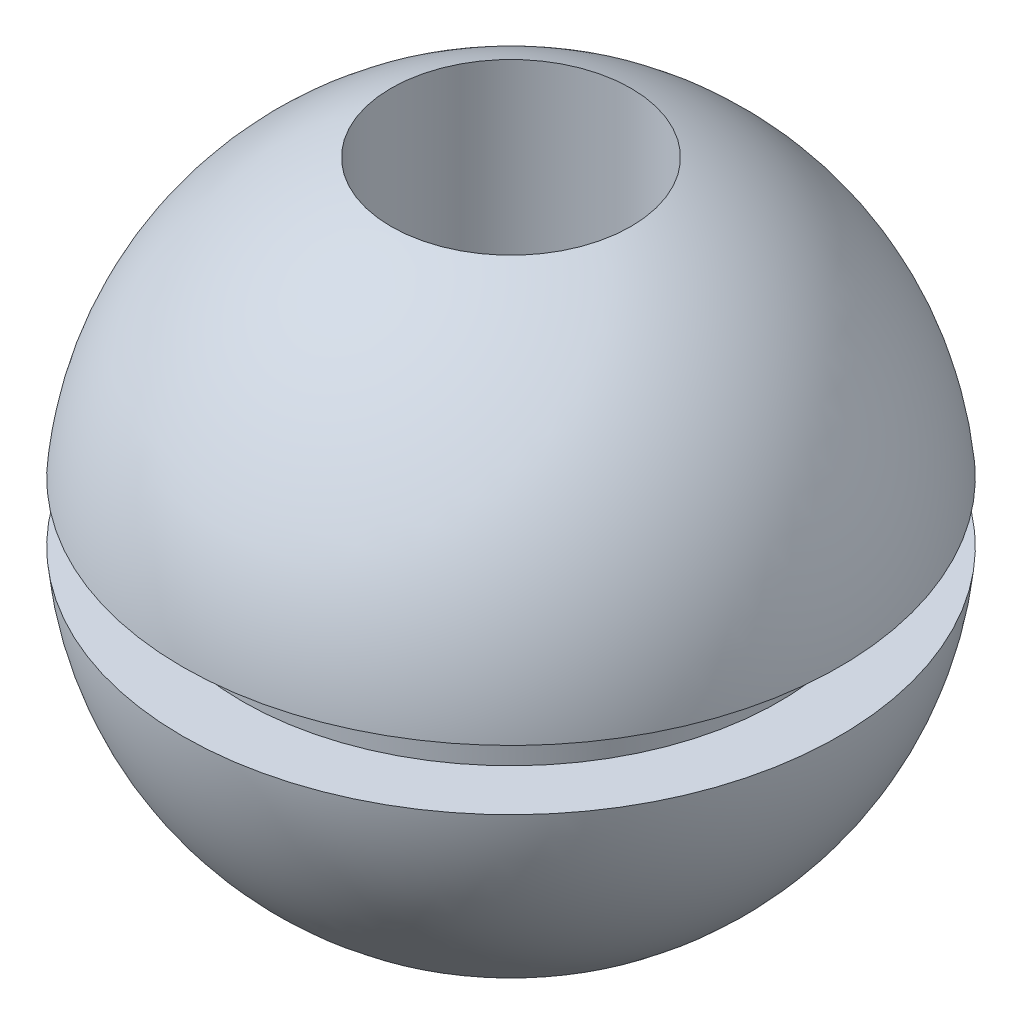
ISO-10303-21;
HEADER;
FILE_DESCRIPTION(('STEP AP214'),'2;1');
FILE_NAME('part.step','',(''),(''),'','','');
FILE_SCHEMA(('AUTOMOTIVE_DESIGN { 1 0 10303 214 1 1 1 1 }'));
ENDSEC;
DATA;
#1=APPLICATION_CONTEXT('core data for automotive mechanical design processes');
#2=APPLICATION_PROTOCOL_DEFINITION('international standard','automotive_design',2000,#1);
#3=PRODUCT_CONTEXT('',#1,'mechanical');
#4=PRODUCT('Part','Part','',(#3));
#5=PRODUCT_RELATED_PRODUCT_CATEGORY('part','',(#4));
#6=PRODUCT_DEFINITION_FORMATION('','',#4);
#7=PRODUCT_DEFINITION_CONTEXT('part definition',#1,'design');
#8=PRODUCT_DEFINITION('design','',#6,#7);
#9=PRODUCT_DEFINITION_SHAPE('','',#8);
#10=(LENGTH_UNIT() NAMED_UNIT(*) SI_UNIT(.MILLI.,.METRE.));
#11=(NAMED_UNIT(*) PLANE_ANGLE_UNIT() SI_UNIT($,.RADIAN.));
#12=(NAMED_UNIT(*) SI_UNIT($,.STERADIAN.) SOLID_ANGLE_UNIT());
#13=UNCERTAINTY_MEASURE_WITH_UNIT(LENGTH_MEASURE(1.E-05),#10,'distance_accuracy_value','');
#14=(GEOMETRIC_REPRESENTATION_CONTEXT(3) GLOBAL_UNCERTAINTY_ASSIGNED_CONTEXT((#13)) GLOBAL_UNIT_ASSIGNED_CONTEXT((#10,
#11,#12)) REPRESENTATION_CONTEXT('',''));
#15=CARTESIAN_POINT('',(0.,0.,0.));
#16=DIRECTION('',(0.,0.,1.));
#17=DIRECTION('',(1.,0.,0.));
#18=AXIS2_PLACEMENT_3D('',#15,#16,#17);
#19=CARTESIAN_POINT('',(0.,11.,0.));
#20=DIRECTION('',(0.,-1.,0.));
#21=DIRECTION('',(-1.,0.,0.));
#22=AXIS2_PLACEMENT_3D('',#19,#20,#21);
#23=SPHERICAL_SURFACE('',#22,11.);
#24=CARTESIAN_POINT('',(0.,10.,0.));
#25=DIRECTION('',(0.,-1.,0.));
#26=DIRECTION('',(0.,0.,-1.));
#27=AXIS2_PLACEMENT_3D('',#24,#25,#26);
#28=CIRCLE('',#27,10.9544511501033);
#29=CARTESIAN_POINT('',(0.,10.,-10.9544511501033));
#30=VERTEX_POINT('',#29);
#31=EDGE_CURVE('E53',#30,#30,#28,.T.);
#32=ORIENTED_EDGE('',*,*,#31,.T.);
#33=EDGE_LOOP('',(#32));
#34=FACE_BOUND('',#33,.T.);
#35=CARTESIAN_POINT('',(0.,0.753049234040402,0.));
#36=DIRECTION('',(0.,1.,0.));
#37=DIRECTION('',(0.,0.,1.));
#38=AXIS2_PLACEMENT_3D('',#35,#36,#37);
#39=CIRCLE('',#38,4.);
#40=CARTESIAN_POINT('',(0.,0.753049234040402,4.));
#41=VERTEX_POINT('',#40);
#42=EDGE_CURVE('E56',#41,#41,#39,.T.);
#43=ORIENTED_EDGE('',*,*,#42,.T.);
#44=EDGE_LOOP('',(#43));
#45=FACE_BOUND('',#44,.T.);
#46=ADVANCED_FACE('F32',(#34,#45),#23,.T.);
#47=CARTESIAN_POINT('',(0.,11.,0.));
#48=DIRECTION('',(0.,-1.,0.));
#49=DIRECTION('',(1.,0.,0.));
#50=AXIS2_PLACEMENT_3D('',#47,#48,#49);
#51=SPHERICAL_SURFACE('',#50,11.);
#52=CARTESIAN_POINT('',(0.,12.,0.));
#53=DIRECTION('',(0.,-1.,0.));
#54=DIRECTION('',(0.,0.,-1.));
#55=AXIS2_PLACEMENT_3D('',#52,#53,#54);
#56=CIRCLE('',#55,10.9544511501033);
#57=CARTESIAN_POINT('',(0.,12.,-10.9544511501033));
#58=VERTEX_POINT('',#57);
#59=EDGE_CURVE('E10',#58,#58,#56,.T.);
#60=ORIENTED_EDGE('',*,*,#59,.F.);
#61=EDGE_LOOP('',(#60));
#62=FACE_BOUND('',#61,.T.);
#63=CARTESIAN_POINT('',(0.,21.2469507659596,0.));
#64=DIRECTION('',(0.,-1.,0.));
#65=DIRECTION('',(0.,0.,-1.));
#66=AXIS2_PLACEMENT_3D('',#63,#64,#65);
#67=CIRCLE('',#66,4.);
#68=CARTESIAN_POINT('',(0.,21.2469507659596,-4.));
#69=VERTEX_POINT('',#68);
#70=EDGE_CURVE('E35',#69,#69,#67,.T.);
#71=ORIENTED_EDGE('',*,*,#70,.T.);
#72=EDGE_LOOP('',(#71));
#73=FACE_BOUND('',#72,.T.);
#74=ADVANCED_FACE('F63',(#62,#73),#51,.T.);
#75=CARTESIAN_POINT('',(8.95445115010332,12.,0.));
#76=DIRECTION('',(0.,-1.,0.));
#77=DIRECTION('',(0.,0.,-1.));
#78=AXIS2_PLACEMENT_3D('',#75,#76,#77);
#79=PLANE('',#78);
#80=ORIENTED_EDGE('',*,*,#59,.T.);
#81=EDGE_LOOP('',(#80));
#82=FACE_BOUND('',#81,.T.);
#83=CARTESIAN_POINT('',(0.,12.,0.));
#84=DIRECTION('',(0.,-1.,0.));
#85=DIRECTION('',(0.,0.,-1.));
#86=AXIS2_PLACEMENT_3D('',#83,#84,#85);
#87=CIRCLE('',#86,8.95445115010332);
#88=CARTESIAN_POINT('',(0.,12.,-8.95445115010332));
#89=VERTEX_POINT('',#88);
#90=EDGE_CURVE('E40',#89,#89,#87,.T.);
#91=ORIENTED_EDGE('',*,*,#90,.F.);
#92=EDGE_LOOP('',(#91));
#93=FACE_BOUND('',#92,.T.);
#94=ADVANCED_FACE('F81',(#82,#93),#79,.T.);
#95=CARTESIAN_POINT('',(0.,0.,0.));
#96=DIRECTION('',(0.,-1.,0.));
#97=DIRECTION('',(0.,0.,-1.));
#98=AXIS2_PLACEMENT_3D('',#95,#96,#97);
#99=CYLINDRICAL_SURFACE('',#98,8.95445115010332);
#100=ORIENTED_EDGE('',*,*,#90,.T.);
#101=EDGE_LOOP('',(#100));
#102=FACE_BOUND('',#101,.T.);
#103=CARTESIAN_POINT('',(0.,10.,0.));
#104=DIRECTION('',(0.,-1.,0.));
#105=DIRECTION('',(0.,0.,-1.));
#106=AXIS2_PLACEMENT_3D('',#103,#104,#105);
#107=CIRCLE('',#106,8.95445115010332);
#108=CARTESIAN_POINT('',(0.,10.,-8.95445115010332));
#109=VERTEX_POINT('',#108);
#110=EDGE_CURVE('E48',#109,#109,#107,.T.);
#111=ORIENTED_EDGE('',*,*,#110,.F.);
#112=EDGE_LOOP('',(#111));
#113=FACE_BOUND('',#112,.T.);
#114=ADVANCED_FACE('F73',(#102,#113),#99,.T.);
#115=CARTESIAN_POINT('',(8.95445115010332,10.,0.));
#116=DIRECTION('',(0.,1.,0.));
#117=DIRECTION('',(0.,0.,1.));
#118=AXIS2_PLACEMENT_3D('',#115,#116,#117);
#119=PLANE('',#118);
#120=ORIENTED_EDGE('',*,*,#110,.T.);
#121=EDGE_LOOP('',(#120));
#122=FACE_BOUND('',#121,.T.);
#123=ORIENTED_EDGE('',*,*,#31,.F.);
#124=EDGE_LOOP('',(#123));
#125=FACE_BOUND('',#124,.T.);
#126=ADVANCED_FACE('F67',(#122,#125),#119,.T.);
#127=CARTESIAN_POINT('',(0.,22.,0.));
#128=DIRECTION('',(0.,-1.,0.));
#129=DIRECTION('',(0.,0.,-1.));
#130=AXIS2_PLACEMENT_3D('',#127,#128,#129);
#131=CYLINDRICAL_SURFACE('',#130,4.);
#132=ORIENTED_EDGE('',*,*,#42,.F.);
#133=EDGE_LOOP('',(#132));
#134=FACE_BOUND('',#133,.T.);
#135=ORIENTED_EDGE('',*,*,#70,.F.);
#136=EDGE_LOOP('',(#135));
#137=FACE_BOUND('',#136,.T.);
#138=ADVANCED_FACE('F65',(#134,#137),#131,.F.);
#139=CLOSED_SHELL('',(#46,#74,#94,#114,#126,#138));
#140=MANIFOLD_SOLID_BREP('B2',#139);
#141=ADVANCED_BREP_SHAPE_REPRESENTATION('',(#18,#140),#14);
#142=SHAPE_DEFINITION_REPRESENTATION(#9,#141);
ENDSEC;
END-ISO-10303-21;
